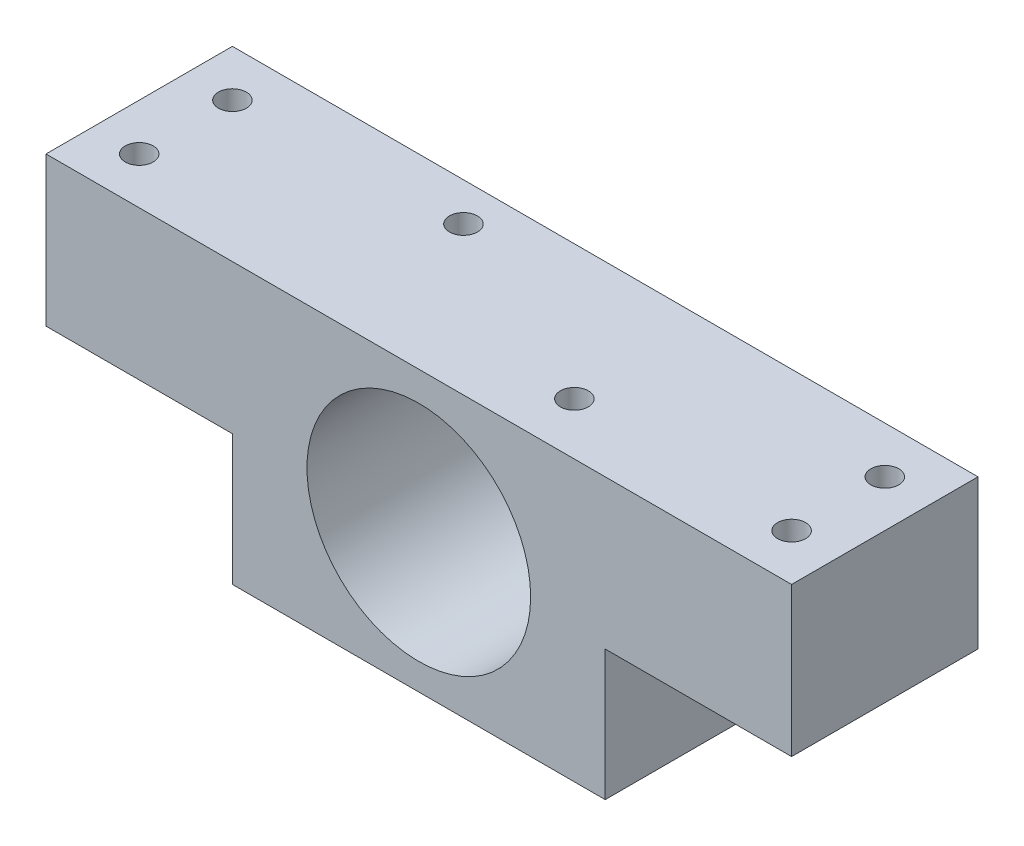
ISO-10303-21;
HEADER;
FILE_DESCRIPTION(('STEP AP214'),'2;1');
FILE_NAME('part.step','',(''),(''),'','','');
FILE_SCHEMA(('AUTOMOTIVE_DESIGN { 1 0 10303 214 1 1 1 1 }'));
ENDSEC;
DATA;
#1=APPLICATION_CONTEXT('core data for automotive mechanical design processes');
#2=APPLICATION_PROTOCOL_DEFINITION('international standard','automotive_design',2000,#1);
#3=PRODUCT_CONTEXT('',#1,'mechanical');
#4=PRODUCT('Part','Part','',(#3));
#5=PRODUCT_RELATED_PRODUCT_CATEGORY('part','',(#4));
#6=PRODUCT_DEFINITION_FORMATION('','',#4);
#7=PRODUCT_DEFINITION_CONTEXT('part definition',#1,'design');
#8=PRODUCT_DEFINITION('design','',#6,#7);
#9=PRODUCT_DEFINITION_SHAPE('','',#8);
#10=(LENGTH_UNIT() NAMED_UNIT(*) SI_UNIT(.MILLI.,.METRE.));
#11=(NAMED_UNIT(*) PLANE_ANGLE_UNIT() SI_UNIT($,.RADIAN.));
#12=(NAMED_UNIT(*) SI_UNIT($,.STERADIAN.) SOLID_ANGLE_UNIT());
#13=UNCERTAINTY_MEASURE_WITH_UNIT(LENGTH_MEASURE(1.E-05),#10,'distance_accuracy_value','');
#14=(GEOMETRIC_REPRESENTATION_CONTEXT(3) GLOBAL_UNCERTAINTY_ASSIGNED_CONTEXT((#13)) GLOBAL_UNIT_ASSIGNED_CONTEXT((#10,
#11,#12)) REPRESENTATION_CONTEXT('',''));
#15=CARTESIAN_POINT('',(0.,0.,0.));
#16=DIRECTION('',(0.,0.,1.));
#17=DIRECTION('',(1.,0.,0.));
#18=AXIS2_PLACEMENT_3D('',#15,#16,#17);
#19=CARTESIAN_POINT('',(40.,30.,10.));
#20=DIRECTION('',(-1.,0.,0.));
#21=DIRECTION('',(0.,0.,1.));
#22=AXIS2_PLACEMENT_3D('',#19,#20,#21);
#23=PLANE('',#22);
#24=DIRECTION('',(0.,-1.,0.));
#25=VECTOR('',#24,1.);
#26=CARTESIAN_POINT('',(40.,30.,10.));
#27=LINE('',#26,#25);
#28=CARTESIAN_POINT('',(40.,30.,10.));
#29=VERTEX_POINT('',#28);
#30=CARTESIAN_POINT('',(40.,14.,10.));
#31=VERTEX_POINT('',#30);
#32=EDGE_CURVE('E128',#29,#31,#27,.T.);
#33=ORIENTED_EDGE('',*,*,#32,.T.);
#34=DIRECTION('',(0.,0.,1.));
#35=VECTOR('',#34,1.);
#36=CARTESIAN_POINT('',(40.,14.,-20.));
#37=LINE('',#36,#35);
#38=CARTESIAN_POINT('',(40.,14.,-10.));
#39=VERTEX_POINT('',#38);
#40=EDGE_CURVE('E176',#39,#31,#37,.T.);
#41=ORIENTED_EDGE('',*,*,#40,.F.);
#42=DIRECTION('',(0.,-1.,0.));
#43=VECTOR('',#42,1.);
#44=CARTESIAN_POINT('',(40.,30.,-10.));
#45=LINE('',#44,#43);
#46=CARTESIAN_POINT('',(40.,30.,-10.));
#47=VERTEX_POINT('',#46);
#48=EDGE_CURVE('E137',#47,#39,#45,.T.);
#49=ORIENTED_EDGE('',*,*,#48,.F.);
#50=DIRECTION('',(0.,0.,-1.));
#51=VECTOR('',#50,1.);
#52=CARTESIAN_POINT('',(40.,30.,10.));
#53=LINE('',#52,#51);
#54=EDGE_CURVE('E118',#29,#47,#53,.T.);
#55=ORIENTED_EDGE('',*,*,#54,.F.);
#56=EDGE_LOOP('',(#33,#41,#49,#55));
#57=FACE_BOUND('',#56,.T.);
#58=ADVANCED_FACE('F37',(#57),#23,.F.);
#59=CARTESIAN_POINT('',(-40.,30.,-10.));
#60=DIRECTION('',(0.,0.,1.));
#61=DIRECTION('',(1.,0.,0.));
#62=AXIS2_PLACEMENT_3D('',#59,#60,#61);
#63=PLANE('',#62);
#64=CARTESIAN_POINT('',(0.,14.84,-10.));
#65=DIRECTION('',(0.,0.,1.));
#66=DIRECTION('',(1.,0.,0.));
#67=AXIS2_PLACEMENT_3D('',#64,#65,#66);
#68=CIRCLE('',#67,12.);
#69=CARTESIAN_POINT('',(12.,14.84,-10.));
#70=VERTEX_POINT('',#69);
#71=EDGE_CURVE('E156',#70,#70,#68,.T.);
#72=ORIENTED_EDGE('',*,*,#71,.T.);
#73=EDGE_LOOP('',(#72));
#74=FACE_BOUND('',#73,.T.);
#75=DIRECTION('',(0.,1.,0.));
#76=VECTOR('',#75,1.);
#77=CARTESIAN_POINT('',(-20.,30.,-10.));
#78=LINE('',#77,#76);
#79=CARTESIAN_POINT('',(-20.,0.,-10.));
#80=VERTEX_POINT('',#79);
#81=CARTESIAN_POINT('',(-20.,14.,-10.));
#82=VERTEX_POINT('',#81);
#83=EDGE_CURVE('E52',#80,#82,#78,.T.);
#84=ORIENTED_EDGE('',*,*,#83,.T.);
#85=DIRECTION('',(-1.,0.,0.));
#86=VECTOR('',#85,1.);
#87=CARTESIAN_POINT('',(-40.,14.,-10.));
#88=LINE('',#87,#86);
#89=CARTESIAN_POINT('',(-40.,14.,-9.99999999999999));
#90=VERTEX_POINT('',#89);
#91=EDGE_CURVE('E124',#82,#90,#88,.T.);
#92=ORIENTED_EDGE('',*,*,#91,.T.);
#93=DIRECTION('',(0.,-1.,0.));
#94=VECTOR('',#93,1.);
#95=CARTESIAN_POINT('',(-40.,30.,-10.));
#96=LINE('',#95,#94);
#97=CARTESIAN_POINT('',(-40.,30.,-10.));
#98=VERTEX_POINT('',#97);
#99=EDGE_CURVE('E134',#98,#90,#96,.T.);
#100=ORIENTED_EDGE('',*,*,#99,.F.);
#101=DIRECTION('',(-1.,0.,0.));
#102=VECTOR('',#101,1.);
#103=CARTESIAN_POINT('',(-40.,30.,-10.));
#104=LINE('',#103,#102);
#105=EDGE_CURVE('E122',#47,#98,#104,.T.);
#106=ORIENTED_EDGE('',*,*,#105,.F.);
#107=ORIENTED_EDGE('',*,*,#48,.T.);
#108=DIRECTION('',(-1.,0.,0.));
#109=VECTOR('',#108,1.);
#110=CARTESIAN_POINT('',(-40.,14.,-10.));
#111=LINE('',#110,#109);
#112=CARTESIAN_POINT('',(20.,14.,-10.));
#113=VERTEX_POINT('',#112);
#114=EDGE_CURVE('E182',#39,#113,#111,.T.);
#115=ORIENTED_EDGE('',*,*,#114,.T.);
#116=DIRECTION('',(0.,-1.,0.));
#117=VECTOR('',#116,1.);
#118=CARTESIAN_POINT('',(20.,30.,-10.));
#119=LINE('',#118,#117);
#120=CARTESIAN_POINT('',(20.,0.,-10.));
#121=VERTEX_POINT('',#120);
#122=EDGE_CURVE('E171',#113,#121,#119,.T.);
#123=ORIENTED_EDGE('',*,*,#122,.T.);
#124=DIRECTION('',(-1.,0.,0.));
#125=VECTOR('',#124,1.);
#126=CARTESIAN_POINT('',(-40.,0.,-10.));
#127=LINE('',#126,#125);
#128=EDGE_CURVE('E119',#121,#80,#127,.T.);
#129=ORIENTED_EDGE('',*,*,#128,.T.);
#130=EDGE_LOOP('',(#84,#92,#100,#106,#107,#115,#123,#129));
#131=FACE_BOUND('',#130,.T.);
#132=ADVANCED_FACE('F201',(#74,#131),#63,.F.);
#133=CARTESIAN_POINT('',(-40.,30.,10.));
#134=DIRECTION('',(1.,0.,0.));
#135=DIRECTION('',(0.,0.,-1.));
#136=AXIS2_PLACEMENT_3D('',#133,#134,#135);
#137=PLANE('',#136);
#138=ORIENTED_EDGE('',*,*,#99,.T.);
#139=DIRECTION('',(0.,0.,1.));
#140=VECTOR('',#139,1.);
#141=CARTESIAN_POINT('',(-40.,14.,-20.));
#142=LINE('',#141,#140);
#143=CARTESIAN_POINT('',(-40.,14.,10.));
#144=VERTEX_POINT('',#143);
#145=EDGE_CURVE('E168',#90,#144,#142,.T.);
#146=ORIENTED_EDGE('',*,*,#145,.T.);
#147=DIRECTION('',(0.,-1.,0.));
#148=VECTOR('',#147,1.);
#149=CARTESIAN_POINT('',(-40.,30.,10.));
#150=LINE('',#149,#148);
#151=CARTESIAN_POINT('',(-40.,30.,10.));
#152=VERTEX_POINT('',#151);
#153=EDGE_CURVE('E131',#152,#144,#150,.T.);
#154=ORIENTED_EDGE('',*,*,#153,.F.);
#155=DIRECTION('',(0.,0.,1.));
#156=VECTOR('',#155,1.);
#157=CARTESIAN_POINT('',(-40.,30.,10.));
#158=LINE('',#157,#156);
#159=EDGE_CURVE('E188',#98,#152,#158,.T.);
#160=ORIENTED_EDGE('',*,*,#159,.F.);
#161=EDGE_LOOP('',(#138,#146,#154,#160));
#162=FACE_BOUND('',#161,.T.);
#163=ADVANCED_FACE('F204',(#162),#137,.F.);
#164=CARTESIAN_POINT('',(-40.,30.,10.));
#165=DIRECTION('',(0.,0.,-1.));
#166=DIRECTION('',(-1.,0.,0.));
#167=AXIS2_PLACEMENT_3D('',#164,#165,#166);
#168=PLANE('',#167);
#169=CARTESIAN_POINT('',(0.,14.84,10.));
#170=DIRECTION('',(0.,0.,1.));
#171=DIRECTION('',(1.,0.,0.));
#172=AXIS2_PLACEMENT_3D('',#169,#170,#171);
#173=CIRCLE('',#172,12.);
#174=CARTESIAN_POINT('',(12.,14.84,10.));
#175=VERTEX_POINT('',#174);
#176=EDGE_CURVE('E152',#175,#175,#173,.T.);
#177=ORIENTED_EDGE('',*,*,#176,.F.);
#178=EDGE_LOOP('',(#177));
#179=FACE_BOUND('',#178,.T.);
#180=ORIENTED_EDGE('',*,*,#153,.T.);
#181=DIRECTION('',(-1.,0.,0.));
#182=VECTOR('',#181,1.);
#183=CARTESIAN_POINT('',(-40.,14.,10.));
#184=LINE('',#183,#182);
#185=CARTESIAN_POINT('',(-20.,14.,10.));
#186=VERTEX_POINT('',#185);
#187=EDGE_CURVE('E114',#186,#144,#184,.T.);
#188=ORIENTED_EDGE('',*,*,#187,.F.);
#189=DIRECTION('',(0.,1.,0.));
#190=VECTOR('',#189,1.);
#191=CARTESIAN_POINT('',(-20.,0.,10.));
#192=LINE('',#191,#190);
#193=CARTESIAN_POINT('',(-20.,0.,10.));
#194=VERTEX_POINT('',#193);
#195=EDGE_CURVE('E103',#194,#186,#192,.T.);
#196=ORIENTED_EDGE('',*,*,#195,.F.);
#197=DIRECTION('',(1.,0.,0.));
#198=VECTOR('',#197,1.);
#199=CARTESIAN_POINT('',(-40.,0.,10.));
#200=LINE('',#199,#198);
#201=CARTESIAN_POINT('',(20.,0.,10.));
#202=VERTEX_POINT('',#201);
#203=EDGE_CURVE('E113',#194,#202,#200,.T.);
#204=ORIENTED_EDGE('',*,*,#203,.T.);
#205=DIRECTION('',(0.,-1.,0.));
#206=VECTOR('',#205,1.);
#207=CARTESIAN_POINT('',(20.,0.,10.));
#208=LINE('',#207,#206);
#209=CARTESIAN_POINT('',(20.,14.,10.));
#210=VERTEX_POINT('',#209);
#211=EDGE_CURVE('E60',#210,#202,#208,.T.);
#212=ORIENTED_EDGE('',*,*,#211,.F.);
#213=DIRECTION('',(-1.,0.,0.));
#214=VECTOR('',#213,1.);
#215=CARTESIAN_POINT('',(40.,14.,10.));
#216=LINE('',#215,#214);
#217=EDGE_CURVE('E161',#31,#210,#216,.T.);
#218=ORIENTED_EDGE('',*,*,#217,.F.);
#219=ORIENTED_EDGE('',*,*,#32,.F.);
#220=DIRECTION('',(1.,0.,0.));
#221=VECTOR('',#220,1.);
#222=CARTESIAN_POINT('',(-40.,30.,10.));
#223=LINE('',#222,#221);
#224=EDGE_CURVE('E132',#152,#29,#223,.T.);
#225=ORIENTED_EDGE('',*,*,#224,.F.);
#226=EDGE_LOOP('',(#180,#188,#196,#204,#212,#218,#219,#225));
#227=FACE_BOUND('',#226,.T.);
#228=ADVANCED_FACE('F112',(#179,#227),#168,.F.);
#229=CARTESIAN_POINT('',(0.,30.,0.));
#230=DIRECTION('',(0.,-1.,0.));
#231=DIRECTION('',(0.,0.,-1.));
#232=AXIS2_PLACEMENT_3D('',#229,#230,#231);
#233=PLANE('',#232);
#234=CARTESIAN_POINT('',(-11.1,30.,-5.89));
#235=DIRECTION('',(0.,1.,0.));
#236=DIRECTION('',(0.,0.,1.));
#237=AXIS2_PLACEMENT_3D('',#234,#235,#236);
#238=CIRCLE('',#237,1.5);
#239=CARTESIAN_POINT('',(-11.1,30.,-4.39));
#240=VERTEX_POINT('',#239);
#241=EDGE_CURVE('E239',#240,#240,#238,.T.);
#242=ORIENTED_EDGE('',*,*,#241,.F.);
#243=EDGE_LOOP('',(#242));
#244=FACE_BOUND('',#243,.T.);
#245=CARTESIAN_POINT('',(11.1,30.,4.41));
#246=DIRECTION('',(0.,1.,0.));
#247=DIRECTION('',(0.,0.,1.));
#248=AXIS2_PLACEMENT_3D('',#245,#246,#247);
#249=CIRCLE('',#248,1.5);
#250=CARTESIAN_POINT('',(11.1,30.,5.91));
#251=VERTEX_POINT('',#250);
#252=EDGE_CURVE('E243',#251,#251,#249,.T.);
#253=ORIENTED_EDGE('',*,*,#252,.F.);
#254=EDGE_LOOP('',(#253));
#255=FACE_BOUND('',#254,.T.);
#256=CARTESIAN_POINT('',(35.,30.,-5.));
#257=DIRECTION('',(0.,1.,0.));
#258=DIRECTION('',(0.,0.,-1.));
#259=AXIS2_PLACEMENT_3D('',#256,#257,#258);
#260=CIRCLE('',#259,1.5);
#261=CARTESIAN_POINT('',(35.,30.,-6.49999999999999));
#262=VERTEX_POINT('',#261);
#263=EDGE_CURVE('E247',#262,#262,#260,.T.);
#264=ORIENTED_EDGE('',*,*,#263,.F.);
#265=EDGE_LOOP('',(#264));
#266=FACE_BOUND('',#265,.T.);
#267=CARTESIAN_POINT('',(35.,30.,5.));
#268=DIRECTION('',(0.,1.,0.));
#269=DIRECTION('',(0.,0.,-1.));
#270=AXIS2_PLACEMENT_3D('',#267,#268,#269);
#271=CIRCLE('',#270,1.5);
#272=CARTESIAN_POINT('',(35.,30.,3.50000000000001));
#273=VERTEX_POINT('',#272);
#274=EDGE_CURVE('E251',#273,#273,#271,.T.);
#275=ORIENTED_EDGE('',*,*,#274,.F.);
#276=EDGE_LOOP('',(#275));
#277=FACE_BOUND('',#276,.T.);
#278=CARTESIAN_POINT('',(-35.,30.,5.));
#279=DIRECTION('',(0.,1.,0.));
#280=DIRECTION('',(0.,0.,1.));
#281=AXIS2_PLACEMENT_3D('',#278,#279,#280);
#282=CIRCLE('',#281,1.5);
#283=CARTESIAN_POINT('',(-35.,30.,6.50000000000001));
#284=VERTEX_POINT('',#283);
#285=EDGE_CURVE('E255',#284,#284,#282,.T.);
#286=ORIENTED_EDGE('',*,*,#285,.F.);
#287=EDGE_LOOP('',(#286));
#288=FACE_BOUND('',#287,.T.);
#289=CARTESIAN_POINT('',(-35.,30.,-5.));
#290=DIRECTION('',(0.,1.,0.));
#291=DIRECTION('',(0.,0.,1.));
#292=AXIS2_PLACEMENT_3D('',#289,#290,#291);
#293=CIRCLE('',#292,1.5);
#294=CARTESIAN_POINT('',(-35.,30.,-3.49999999999999));
#295=VERTEX_POINT('',#294);
#296=EDGE_CURVE('E145',#295,#295,#293,.T.);
#297=ORIENTED_EDGE('',*,*,#296,.F.);
#298=EDGE_LOOP('',(#297));
#299=FACE_BOUND('',#298,.T.);
#300=ORIENTED_EDGE('',*,*,#54,.T.);
#301=ORIENTED_EDGE('',*,*,#105,.T.);
#302=ORIENTED_EDGE('',*,*,#159,.T.);
#303=ORIENTED_EDGE('',*,*,#224,.T.);
#304=EDGE_LOOP('',(#300,#301,#302,#303));
#305=FACE_BOUND('',#304,.T.);
#306=ADVANCED_FACE('F192',(#244,#255,#266,#277,#288,#299,#305),#233,.F.);
#307=CARTESIAN_POINT('',(0.,0.,0.));
#308=DIRECTION('',(0.,-1.,0.));
#309=DIRECTION('',(0.,0.,-1.));
#310=AXIS2_PLACEMENT_3D('',#307,#308,#309);
#311=PLANE('',#310);
#312=DIRECTION('',(0.,0.,1.));
#313=VECTOR('',#312,1.);
#314=CARTESIAN_POINT('',(-20.,0.,0.));
#315=LINE('',#314,#313);
#316=EDGE_CURVE('E11',#80,#194,#315,.T.);
#317=ORIENTED_EDGE('',*,*,#316,.F.);
#318=ORIENTED_EDGE('',*,*,#128,.F.);
#319=DIRECTION('',(0.,0.,-1.));
#320=VECTOR('',#319,1.);
#321=CARTESIAN_POINT('',(20.,0.,0.));
#322=LINE('',#321,#320);
#323=EDGE_CURVE('E45',#202,#121,#322,.T.);
#324=ORIENTED_EDGE('',*,*,#323,.F.);
#325=ORIENTED_EDGE('',*,*,#203,.F.);
#326=EDGE_LOOP('',(#317,#318,#324,#325));
#327=FACE_BOUND('',#326,.T.);
#328=ADVANCED_FACE('F117',(#327),#311,.T.);
#329=CARTESIAN_POINT('',(40.,14.,-20.));
#330=DIRECTION('',(0.,1.,0.));
#331=DIRECTION('',(-1.,0.,0.));
#332=AXIS2_PLACEMENT_3D('',#329,#330,#331);
#333=PLANE('',#332);
#334=CARTESIAN_POINT('',(35.,14.,-5.));
#335=DIRECTION('',(0.,1.,0.));
#336=DIRECTION('',(-1.,0.,0.));
#337=AXIS2_PLACEMENT_3D('',#334,#335,#336);
#338=CIRCLE('',#337,1.5);
#339=CARTESIAN_POINT('',(33.5,14.,-5.));
#340=VERTEX_POINT('',#339);
#341=EDGE_CURVE('E40',#340,#340,#338,.T.);
#342=ORIENTED_EDGE('',*,*,#341,.T.);
#343=EDGE_LOOP('',(#342));
#344=FACE_BOUND('',#343,.T.);
#345=CARTESIAN_POINT('',(35.,14.,5.));
#346=DIRECTION('',(0.,1.,0.));
#347=DIRECTION('',(-1.,0.,0.));
#348=AXIS2_PLACEMENT_3D('',#345,#346,#347);
#349=CIRCLE('',#348,1.5);
#350=CARTESIAN_POINT('',(33.5,14.,5.));
#351=VERTEX_POINT('',#350);
#352=EDGE_CURVE('E147',#351,#351,#349,.T.);
#353=ORIENTED_EDGE('',*,*,#352,.T.);
#354=EDGE_LOOP('',(#353));
#355=FACE_BOUND('',#354,.T.);
#356=ORIENTED_EDGE('',*,*,#40,.T.);
#357=ORIENTED_EDGE('',*,*,#217,.T.);
#358=DIRECTION('',(0.,0.,1.));
#359=VECTOR('',#358,1.);
#360=CARTESIAN_POINT('',(20.,14.,-20.));
#361=LINE('',#360,#359);
#362=EDGE_CURVE('E115',#113,#210,#361,.T.);
#363=ORIENTED_EDGE('',*,*,#362,.F.);
#364=ORIENTED_EDGE('',*,*,#114,.F.);
#365=EDGE_LOOP('',(#356,#357,#363,#364));
#366=FACE_BOUND('',#365,.T.);
#367=ADVANCED_FACE('F210',(#344,#355,#366),#333,.F.);
#368=CARTESIAN_POINT('',(20.,0.,-20.));
#369=DIRECTION('',(-1.,0.,0.));
#370=DIRECTION('',(0.,-1.,0.));
#371=AXIS2_PLACEMENT_3D('',#368,#369,#370);
#372=PLANE('',#371);
#373=ORIENTED_EDGE('',*,*,#362,.T.);
#374=ORIENTED_EDGE('',*,*,#211,.T.);
#375=ORIENTED_EDGE('',*,*,#323,.T.);
#376=ORIENTED_EDGE('',*,*,#122,.F.);
#377=EDGE_LOOP('',(#373,#374,#375,#376));
#378=FACE_BOUND('',#377,.T.);
#379=ADVANCED_FACE('F208',(#378),#372,.F.);
#380=CARTESIAN_POINT('',(-40.,14.,-20.));
#381=DIRECTION('',(0.,1.,0.));
#382=DIRECTION('',(0.,0.,1.));
#383=AXIS2_PLACEMENT_3D('',#380,#381,#382);
#384=PLANE('',#383);
#385=CARTESIAN_POINT('',(-35.,14.,5.));
#386=DIRECTION('',(0.,1.,0.));
#387=DIRECTION('',(0.,0.,1.));
#388=AXIS2_PLACEMENT_3D('',#385,#386,#387);
#389=CIRCLE('',#388,1.5);
#390=CARTESIAN_POINT('',(-35.,14.,6.50000000000001));
#391=VERTEX_POINT('',#390);
#392=EDGE_CURVE('E144',#391,#391,#389,.T.);
#393=ORIENTED_EDGE('',*,*,#392,.T.);
#394=EDGE_LOOP('',(#393));
#395=FACE_BOUND('',#394,.T.);
#396=CARTESIAN_POINT('',(-35.,14.,-5.));
#397=DIRECTION('',(0.,1.,0.));
#398=DIRECTION('',(0.,0.,1.));
#399=AXIS2_PLACEMENT_3D('',#396,#397,#398);
#400=CIRCLE('',#399,1.5);
#401=CARTESIAN_POINT('',(-35.,14.,-3.49999999999999));
#402=VERTEX_POINT('',#401);
#403=EDGE_CURVE('E141',#402,#402,#400,.T.);
#404=ORIENTED_EDGE('',*,*,#403,.T.);
#405=EDGE_LOOP('',(#404));
#406=FACE_BOUND('',#405,.T.);
#407=DIRECTION('',(0.,0.,1.));
#408=VECTOR('',#407,1.);
#409=CARTESIAN_POINT('',(-20.,14.,-20.));
#410=LINE('',#409,#408);
#411=EDGE_CURVE('E167',#82,#186,#410,.T.);
#412=ORIENTED_EDGE('',*,*,#411,.T.);
#413=ORIENTED_EDGE('',*,*,#187,.T.);
#414=ORIENTED_EDGE('',*,*,#145,.F.);
#415=ORIENTED_EDGE('',*,*,#91,.F.);
#416=EDGE_LOOP('',(#412,#413,#414,#415));
#417=FACE_BOUND('',#416,.T.);
#418=ADVANCED_FACE('F206',(#395,#406,#417),#384,.F.);
#419=CARTESIAN_POINT('',(-20.,0.,-20.));
#420=DIRECTION('',(1.,0.,0.));
#421=DIRECTION('',(0.,0.,-1.));
#422=AXIS2_PLACEMENT_3D('',#419,#420,#421);
#423=PLANE('',#422);
#424=ORIENTED_EDGE('',*,*,#316,.T.);
#425=ORIENTED_EDGE('',*,*,#195,.T.);
#426=ORIENTED_EDGE('',*,*,#411,.F.);
#427=ORIENTED_EDGE('',*,*,#83,.F.);
#428=EDGE_LOOP('',(#424,#425,#426,#427));
#429=FACE_BOUND('',#428,.T.);
#430=ADVANCED_FACE('F102',(#429),#423,.F.);
#431=CARTESIAN_POINT('',(0.,14.84,-20.));
#432=DIRECTION('',(0.,0.,1.));
#433=DIRECTION('',(1.,0.,0.));
#434=AXIS2_PLACEMENT_3D('',#431,#432,#433);
#435=CYLINDRICAL_SURFACE('',#434,12.);
#436=ORIENTED_EDGE('',*,*,#176,.T.);
#437=EDGE_LOOP('',(#436));
#438=FACE_BOUND('',#437,.T.);
#439=ORIENTED_EDGE('',*,*,#71,.F.);
#440=EDGE_LOOP('',(#439));
#441=FACE_BOUND('',#440,.T.);
#442=ADVANCED_FACE('F301',(#438,#441),#435,.F.);
#443=CARTESIAN_POINT('',(-35.,0.,-5.));
#444=DIRECTION('',(0.,1.,0.));
#445=DIRECTION('',(0.,0.,1.));
#446=AXIS2_PLACEMENT_3D('',#443,#444,#445);
#447=CYLINDRICAL_SURFACE('',#446,1.5);
#448=ORIENTED_EDGE('',*,*,#296,.T.);
#449=EDGE_LOOP('',(#448));
#450=FACE_BOUND('',#449,.T.);
#451=ORIENTED_EDGE('',*,*,#403,.F.);
#452=EDGE_LOOP('',(#451));
#453=FACE_BOUND('',#452,.T.);
#454=ADVANCED_FACE('F295',(#450,#453),#447,.F.);
#455=CARTESIAN_POINT('',(-35.,0.,5.));
#456=DIRECTION('',(0.,1.,0.));
#457=DIRECTION('',(0.,0.,1.));
#458=AXIS2_PLACEMENT_3D('',#455,#456,#457);
#459=CYLINDRICAL_SURFACE('',#458,1.5);
#460=ORIENTED_EDGE('',*,*,#285,.T.);
#461=EDGE_LOOP('',(#460));
#462=FACE_BOUND('',#461,.T.);
#463=ORIENTED_EDGE('',*,*,#392,.F.);
#464=EDGE_LOOP('',(#463));
#465=FACE_BOUND('',#464,.T.);
#466=ADVANCED_FACE('F292',(#462,#465),#459,.F.);
#467=CARTESIAN_POINT('',(35.,0.,5.));
#468=DIRECTION('',(0.,1.,0.));
#469=DIRECTION('',(0.,0.,1.));
#470=AXIS2_PLACEMENT_3D('',#467,#468,#469);
#471=CYLINDRICAL_SURFACE('',#470,1.5);
#472=ORIENTED_EDGE('',*,*,#274,.T.);
#473=EDGE_LOOP('',(#472));
#474=FACE_BOUND('',#473,.T.);
#475=ORIENTED_EDGE('',*,*,#352,.F.);
#476=EDGE_LOOP('',(#475));
#477=FACE_BOUND('',#476,.T.);
#478=ADVANCED_FACE('F288',(#474,#477),#471,.F.);
#479=CARTESIAN_POINT('',(35.,0.,-5.));
#480=DIRECTION('',(0.,1.,0.));
#481=DIRECTION('',(0.,0.,1.));
#482=AXIS2_PLACEMENT_3D('',#479,#480,#481);
#483=CYLINDRICAL_SURFACE('',#482,1.5);
#484=ORIENTED_EDGE('',*,*,#263,.T.);
#485=EDGE_LOOP('',(#484));
#486=FACE_BOUND('',#485,.T.);
#487=ORIENTED_EDGE('',*,*,#341,.F.);
#488=EDGE_LOOP('',(#487));
#489=FACE_BOUND('',#488,.T.);
#490=ADVANCED_FACE('F279',(#486,#489),#483,.F.);
#491=CARTESIAN_POINT('',(11.1,27.,4.41));
#492=DIRECTION('',(0.,1.,0.));
#493=DIRECTION('',(0.,0.,1.));
#494=AXIS2_PLACEMENT_3D('',#491,#492,#493);
#495=CYLINDRICAL_SURFACE('',#494,1.5);
#496=CARTESIAN_POINT('',(11.1,27.,4.41));
#497=DIRECTION('',(0.,1.,0.));
#498=DIRECTION('',(0.,0.,1.));
#499=AXIS2_PLACEMENT_3D('',#496,#497,#498);
#500=CIRCLE('',#499,1.5);
#501=CARTESIAN_POINT('',(11.1,27.,5.91));
#502=VERTEX_POINT('',#501);
#503=EDGE_CURVE('E270',#502,#502,#500,.T.);
#504=ORIENTED_EDGE('',*,*,#503,.F.);
#505=EDGE_LOOP('',(#504));
#506=FACE_BOUND('',#505,.T.);
#507=ORIENTED_EDGE('',*,*,#252,.T.);
#508=EDGE_LOOP('',(#507));
#509=FACE_BOUND('',#508,.T.);
#510=ADVANCED_FACE('F276',(#506,#509),#495,.F.);
#511=CARTESIAN_POINT('',(11.1,27.,4.41));
#512=DIRECTION('',(0.,1.,0.));
#513=DIRECTION('',(0.,0.,1.));
#514=AXIS2_PLACEMENT_3D('',#511,#512,#513);
#515=PLANE('',#514);
#516=ORIENTED_EDGE('',*,*,#503,.T.);
#517=EDGE_LOOP('',(#516));
#518=FACE_BOUND('',#517,.T.);
#519=ADVANCED_FACE('F278',(#518),#515,.T.);
#520=CARTESIAN_POINT('',(-11.1,27.,-5.89));
#521=DIRECTION('',(0.,1.,0.));
#522=DIRECTION('',(0.,0.,1.));
#523=AXIS2_PLACEMENT_3D('',#520,#521,#522);
#524=CYLINDRICAL_SURFACE('',#523,1.5);
#525=CARTESIAN_POINT('',(-11.1,27.,-5.89));
#526=DIRECTION('',(0.,1.,0.));
#527=DIRECTION('',(0.,0.,1.));
#528=AXIS2_PLACEMENT_3D('',#525,#526,#527);
#529=CIRCLE('',#528,1.5);
#530=CARTESIAN_POINT('',(-11.1,27.,-4.39));
#531=VERTEX_POINT('',#530);
#532=EDGE_CURVE('E264',#531,#531,#529,.T.);
#533=ORIENTED_EDGE('',*,*,#532,.F.);
#534=EDGE_LOOP('',(#533));
#535=FACE_BOUND('',#534,.T.);
#536=ORIENTED_EDGE('',*,*,#241,.T.);
#537=EDGE_LOOP('',(#536));
#538=FACE_BOUND('',#537,.T.);
#539=ADVANCED_FACE('F286',(#535,#538),#524,.F.);
#540=CARTESIAN_POINT('',(-11.1,27.,-5.89));
#541=DIRECTION('',(0.,1.,0.));
#542=DIRECTION('',(0.,0.,1.));
#543=AXIS2_PLACEMENT_3D('',#540,#541,#542);
#544=PLANE('',#543);
#545=ORIENTED_EDGE('',*,*,#532,.T.);
#546=EDGE_LOOP('',(#545));
#547=FACE_BOUND('',#546,.T.);
#548=ADVANCED_FACE('F359',(#547),#544,.T.);
#549=CLOSED_SHELL('',(#58,#132,#163,#228,#306,#328,#367,#379,#418,#430,#442,#454,#466,#478,#490,
#510,#519,#539,#548));
#550=MANIFOLD_SOLID_BREP('B2',#549);
#551=ADVANCED_BREP_SHAPE_REPRESENTATION('',(#18,#550),#14);
#552=SHAPE_DEFINITION_REPRESENTATION(#9,#551);
ENDSEC;
END-ISO-10303-21;
